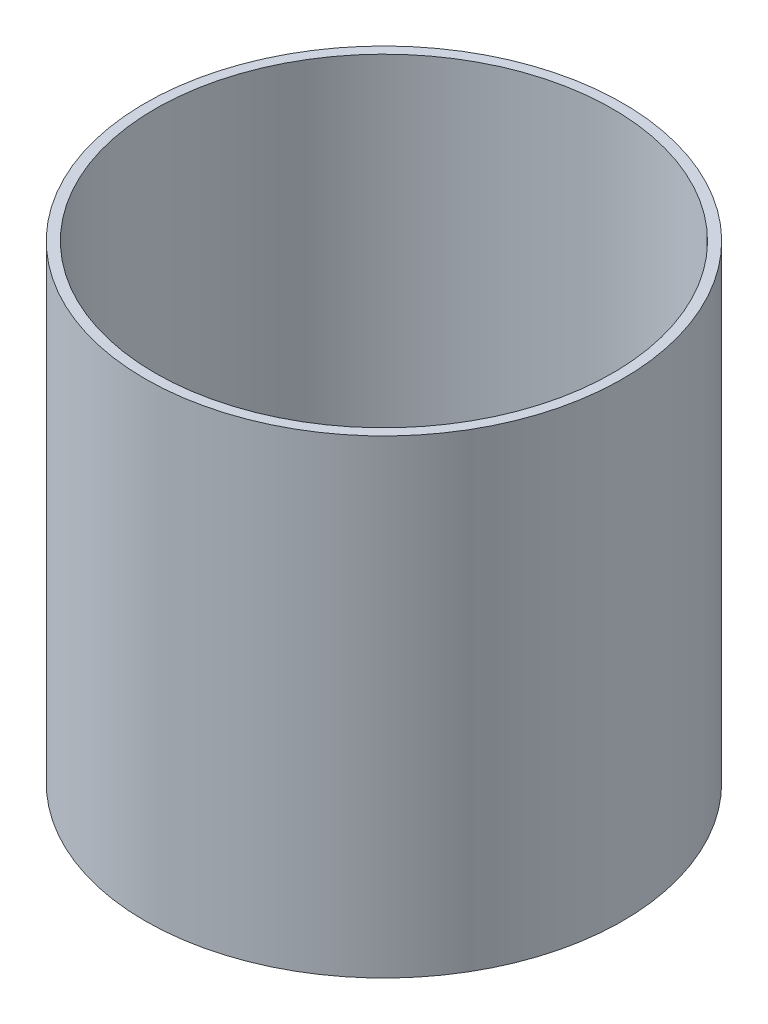
ISO-10303-21;
HEADER;
FILE_DESCRIPTION(('STEP AP214'),'2;1');
FILE_NAME('part.step','',(''),(''),'','','');
FILE_SCHEMA(('AUTOMOTIVE_DESIGN { 1 0 10303 214 1 1 1 1 }'));
ENDSEC;
DATA;
#1=APPLICATION_CONTEXT('core data for automotive mechanical design processes');
#2=APPLICATION_PROTOCOL_DEFINITION('international standard','automotive_design',2000,#1);
#3=PRODUCT_CONTEXT('',#1,'mechanical');
#4=PRODUCT('Part','Part','',(#3));
#5=PRODUCT_RELATED_PRODUCT_CATEGORY('part','',(#4));
#6=PRODUCT_DEFINITION_FORMATION('','',#4);
#7=PRODUCT_DEFINITION_CONTEXT('part definition',#1,'design');
#8=PRODUCT_DEFINITION('design','',#6,#7);
#9=PRODUCT_DEFINITION_SHAPE('','',#8);
#10=(LENGTH_UNIT() NAMED_UNIT(*) SI_UNIT(.MILLI.,.METRE.));
#11=(NAMED_UNIT(*) PLANE_ANGLE_UNIT() SI_UNIT($,.RADIAN.));
#12=(NAMED_UNIT(*) SI_UNIT($,.STERADIAN.) SOLID_ANGLE_UNIT());
#13=UNCERTAINTY_MEASURE_WITH_UNIT(LENGTH_MEASURE(1.E-05),#10,'distance_accuracy_value','');
#14=(GEOMETRIC_REPRESENTATION_CONTEXT(3) GLOBAL_UNCERTAINTY_ASSIGNED_CONTEXT((#13)) GLOBAL_UNIT_ASSIGNED_CONTEXT((#10,
#11,#12)) REPRESENTATION_CONTEXT('',''));
#15=CARTESIAN_POINT('',(0.,0.,0.));
#16=DIRECTION('',(0.,0.,1.));
#17=DIRECTION('',(1.,0.,0.));
#18=AXIS2_PLACEMENT_3D('',#15,#16,#17);
#19=CARTESIAN_POINT('',(0.,43.25,0.));
#20=DIRECTION('',(0.,1.,0.));
#21=DIRECTION('',(0.,0.,1.));
#22=AXIS2_PLACEMENT_3D('',#19,#20,#21);
#23=PLANE('',#22);
#24=CARTESIAN_POINT('',(0.,43.25,0.));
#25=DIRECTION('',(0.,1.,0.));
#26=DIRECTION('',(0.,0.,1.));
#27=AXIS2_PLACEMENT_3D('',#24,#25,#26);
#28=CIRCLE('',#27,22.);
#29=CARTESIAN_POINT('',(0.,43.25,22.));
#30=VERTEX_POINT('',#29);
#31=EDGE_CURVE('E10',#30,#30,#28,.T.);
#32=ORIENTED_EDGE('',*,*,#31,.T.);
#33=EDGE_LOOP('',(#32));
#34=FACE_BOUND('',#33,.T.);
#35=CARTESIAN_POINT('',(0.,43.25,0.));
#36=DIRECTION('',(0.,1.,0.));
#37=DIRECTION('',(0.,0.,1.));
#38=AXIS2_PLACEMENT_3D('',#35,#36,#37);
#39=CIRCLE('',#38,21.08);
#40=CARTESIAN_POINT('',(0.,43.25,21.08));
#41=VERTEX_POINT('',#40);
#42=EDGE_CURVE('E42',#41,#41,#39,.T.);
#43=ORIENTED_EDGE('',*,*,#42,.F.);
#44=EDGE_LOOP('',(#43));
#45=FACE_BOUND('',#44,.T.);
#46=ADVANCED_FACE('F31',(#34,#45),#23,.T.);
#47=CARTESIAN_POINT('',(0.,0.,0.));
#48=DIRECTION('',(0.,1.,0.));
#49=DIRECTION('',(0.,0.,1.));
#50=AXIS2_PLACEMENT_3D('',#47,#48,#49);
#51=PLANE('',#50);
#52=CARTESIAN_POINT('',(0.,0.,0.));
#53=DIRECTION('',(0.,1.,0.));
#54=DIRECTION('',(0.,0.,1.));
#55=AXIS2_PLACEMENT_3D('',#52,#53,#54);
#56=CIRCLE('',#55,22.);
#57=CARTESIAN_POINT('',(0.,0.,22.));
#58=VERTEX_POINT('',#57);
#59=EDGE_CURVE('E35',#58,#58,#56,.T.);
#60=ORIENTED_EDGE('',*,*,#59,.F.);
#61=EDGE_LOOP('',(#60));
#62=FACE_BOUND('',#61,.T.);
#63=CARTESIAN_POINT('',(0.,0.,0.));
#64=DIRECTION('',(0.,1.,0.));
#65=DIRECTION('',(0.,0.,1.));
#66=AXIS2_PLACEMENT_3D('',#63,#64,#65);
#67=CIRCLE('',#66,21.08);
#68=CARTESIAN_POINT('',(0.,0.,21.08));
#69=VERTEX_POINT('',#68);
#70=EDGE_CURVE('E44',#69,#69,#67,.T.);
#71=ORIENTED_EDGE('',*,*,#70,.T.);
#72=EDGE_LOOP('',(#71));
#73=FACE_BOUND('',#72,.T.);
#74=ADVANCED_FACE('F54',(#62,#73),#51,.F.);
#75=CARTESIAN_POINT('',(0.,43.25,0.));
#76=DIRECTION('',(0.,-1.,0.));
#77=DIRECTION('',(0.,0.,-1.));
#78=AXIS2_PLACEMENT_3D('',#75,#76,#77);
#79=CYLINDRICAL_SURFACE('',#78,22.);
#80=ORIENTED_EDGE('',*,*,#31,.F.);
#81=EDGE_LOOP('',(#80));
#82=FACE_BOUND('',#81,.T.);
#83=ORIENTED_EDGE('',*,*,#59,.T.);
#84=EDGE_LOOP('',(#83));
#85=FACE_BOUND('',#84,.T.);
#86=ADVANCED_FACE('F33',(#82,#85),#79,.T.);
#87=CARTESIAN_POINT('',(0.,43.25,0.));
#88=DIRECTION('',(0.,-1.,0.));
#89=DIRECTION('',(0.,0.,-1.));
#90=AXIS2_PLACEMENT_3D('',#87,#88,#89);
#91=CYLINDRICAL_SURFACE('',#90,21.08);
#92=ORIENTED_EDGE('',*,*,#42,.T.);
#93=EDGE_LOOP('',(#92));
#94=FACE_BOUND('',#93,.T.);
#95=ORIENTED_EDGE('',*,*,#70,.F.);
#96=EDGE_LOOP('',(#95));
#97=FACE_BOUND('',#96,.T.);
#98=ADVANCED_FACE('F50',(#94,#97),#91,.F.);
#99=CLOSED_SHELL('',(#46,#74,#86,#98));
#100=MANIFOLD_SOLID_BREP('B2',#99);
#101=ADVANCED_BREP_SHAPE_REPRESENTATION('',(#18,#100),#14);
#102=SHAPE_DEFINITION_REPRESENTATION(#9,#101);
ENDSEC;
END-ISO-10303-21;
